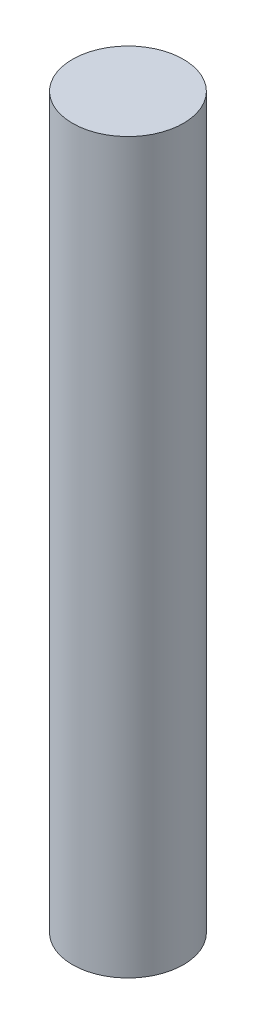
ISO-10303-21;
HEADER;
FILE_DESCRIPTION(('STEP AP214'),'2;1');
FILE_NAME('part.step','',(''),(''),'','','');
FILE_SCHEMA(('AUTOMOTIVE_DESIGN { 1 0 10303 214 1 1 1 1 }'));
ENDSEC;
DATA;
#1=APPLICATION_CONTEXT('core data for automotive mechanical design processes');
#2=APPLICATION_PROTOCOL_DEFINITION('international standard','automotive_design',2000,#1);
#3=PRODUCT_CONTEXT('',#1,'mechanical');
#4=PRODUCT('Part','Part','',(#3));
#5=PRODUCT_RELATED_PRODUCT_CATEGORY('part','',(#4));
#6=PRODUCT_DEFINITION_FORMATION('','',#4);
#7=PRODUCT_DEFINITION_CONTEXT('part definition',#1,'design');
#8=PRODUCT_DEFINITION('design','',#6,#7);
#9=PRODUCT_DEFINITION_SHAPE('','',#8);
#10=(LENGTH_UNIT() NAMED_UNIT(*) SI_UNIT(.MILLI.,.METRE.));
#11=(NAMED_UNIT(*) PLANE_ANGLE_UNIT() SI_UNIT($,.RADIAN.));
#12=(NAMED_UNIT(*) SI_UNIT($,.STERADIAN.) SOLID_ANGLE_UNIT());
#13=UNCERTAINTY_MEASURE_WITH_UNIT(LENGTH_MEASURE(1.E-05),#10,'distance_accuracy_value','');
#14=(GEOMETRIC_REPRESENTATION_CONTEXT(3) GLOBAL_UNCERTAINTY_ASSIGNED_CONTEXT((#13)) GLOBAL_UNIT_ASSIGNED_CONTEXT((#10,
#11,#12)) REPRESENTATION_CONTEXT('',''));
#15=CARTESIAN_POINT('',(0.,0.,0.));
#16=DIRECTION('',(0.,0.,1.));
#17=DIRECTION('',(1.,0.,0.));
#18=AXIS2_PLACEMENT_3D('',#15,#16,#17);
#19=CARTESIAN_POINT('',(0.,530.86,0.));
#20=DIRECTION('',(0.,-1.,0.));
#21=DIRECTION('',(0.,0.,-1.));
#22=AXIS2_PLACEMENT_3D('',#19,#20,#21);
#23=CYLINDRICAL_SURFACE('',#22,40.4114);
#24=CARTESIAN_POINT('',(0.,530.86,0.));
#25=DIRECTION('',(0.,1.,0.));
#26=DIRECTION('',(0.,0.,1.));
#27=AXIS2_PLACEMENT_3D('',#24,#25,#26);
#28=CIRCLE('',#27,40.4114);
#29=CARTESIAN_POINT('',(0.,530.86,40.4114));
#30=VERTEX_POINT('',#29);
#31=EDGE_CURVE('E10',#30,#30,#28,.T.);
#32=ORIENTED_EDGE('',*,*,#31,.F.);
#33=EDGE_LOOP('',(#32));
#34=FACE_BOUND('',#33,.T.);
#35=CARTESIAN_POINT('',(0.,0.,0.));
#36=DIRECTION('',(0.,1.,0.));
#37=DIRECTION('',(0.,0.,1.));
#38=AXIS2_PLACEMENT_3D('',#35,#36,#37);
#39=CIRCLE('',#38,40.4114);
#40=CARTESIAN_POINT('',(0.,0.,40.4114));
#41=VERTEX_POINT('',#40);
#42=EDGE_CURVE('E38',#41,#41,#39,.T.);
#43=ORIENTED_EDGE('',*,*,#42,.T.);
#44=EDGE_LOOP('',(#43));
#45=FACE_BOUND('',#44,.T.);
#46=ADVANCED_FACE('F35',(#34,#45),#23,.T.);
#47=CARTESIAN_POINT('',(0.,530.86,0.));
#48=DIRECTION('',(0.,1.,0.));
#49=DIRECTION('',(0.,0.,1.));
#50=AXIS2_PLACEMENT_3D('',#47,#48,#49);
#51=PLANE('',#50);
#52=ORIENTED_EDGE('',*,*,#31,.T.);
#53=EDGE_LOOP('',(#52));
#54=FACE_BOUND('',#53,.T.);
#55=ADVANCED_FACE('F50',(#54),#51,.T.);
#56=CARTESIAN_POINT('',(0.,0.,0.));
#57=DIRECTION('',(0.,1.,0.));
#58=DIRECTION('',(0.,0.,1.));
#59=AXIS2_PLACEMENT_3D('',#56,#57,#58);
#60=PLANE('',#59);
#61=ORIENTED_EDGE('',*,*,#42,.F.);
#62=EDGE_LOOP('',(#61));
#63=FACE_BOUND('',#62,.T.);
#64=ADVANCED_FACE('F48',(#63),#60,.F.);
#65=CLOSED_SHELL('',(#46,#55,#64));
#66=MANIFOLD_SOLID_BREP('B2',#65);
#67=ADVANCED_BREP_SHAPE_REPRESENTATION('',(#18,#66),#14);
#68=SHAPE_DEFINITION_REPRESENTATION(#9,#67);
ENDSEC;
END-ISO-10303-21;
